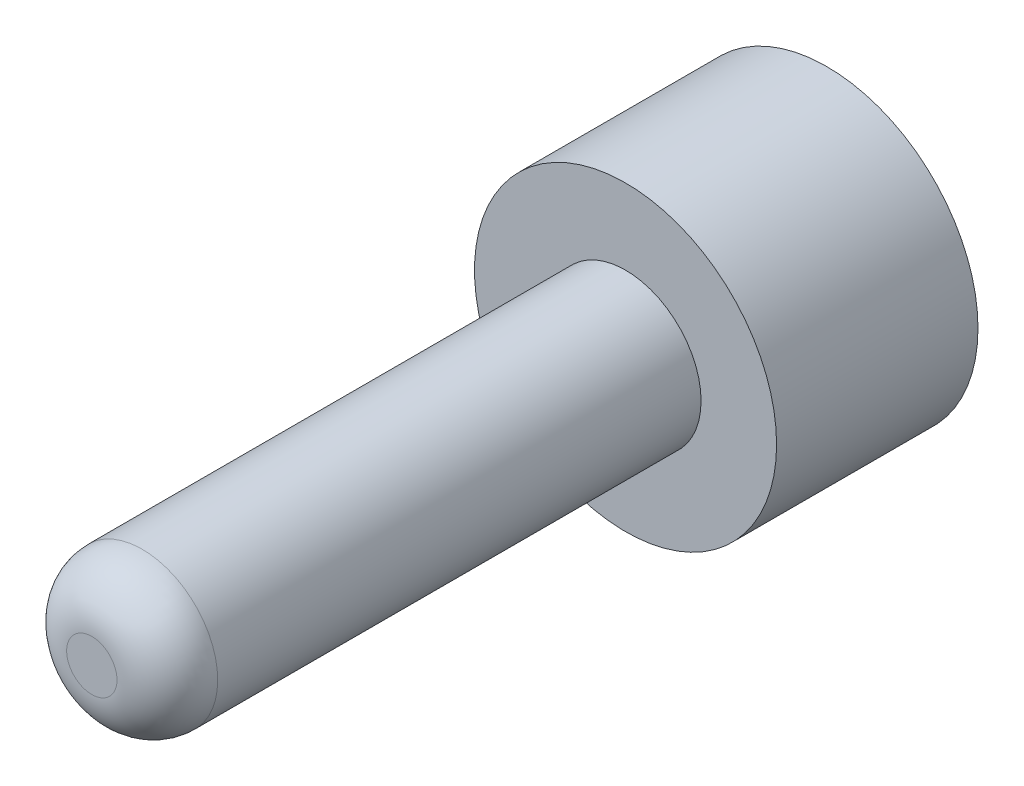
ISO-10303-21;
HEADER;
FILE_DESCRIPTION(('STEP AP214'),'2;1');
FILE_NAME('part.step','',(''),(''),'','','');
FILE_SCHEMA(('AUTOMOTIVE_DESIGN { 1 0 10303 214 1 1 1 1 }'));
ENDSEC;
DATA;
#1=APPLICATION_CONTEXT('core data for automotive mechanical design processes');
#2=APPLICATION_PROTOCOL_DEFINITION('international standard','automotive_design',2000,#1);
#3=PRODUCT_CONTEXT('',#1,'mechanical');
#4=PRODUCT('Part','Part','',(#3));
#5=PRODUCT_RELATED_PRODUCT_CATEGORY('part','',(#4));
#6=PRODUCT_DEFINITION_FORMATION('','',#4);
#7=PRODUCT_DEFINITION_CONTEXT('part definition',#1,'design');
#8=PRODUCT_DEFINITION('design','',#6,#7);
#9=PRODUCT_DEFINITION_SHAPE('','',#8);
#10=(LENGTH_UNIT() NAMED_UNIT(*) SI_UNIT(.MILLI.,.METRE.));
#11=(NAMED_UNIT(*) PLANE_ANGLE_UNIT() SI_UNIT($,.RADIAN.));
#12=(NAMED_UNIT(*) SI_UNIT($,.STERADIAN.) SOLID_ANGLE_UNIT());
#13=UNCERTAINTY_MEASURE_WITH_UNIT(LENGTH_MEASURE(1.E-05),#10,'distance_accuracy_value','');
#14=(GEOMETRIC_REPRESENTATION_CONTEXT(3) GLOBAL_UNCERTAINTY_ASSIGNED_CONTEXT((#13)) GLOBAL_UNIT_ASSIGNED_CONTEXT((#10,
#11,#12)) REPRESENTATION_CONTEXT('',''));
#15=CARTESIAN_POINT('',(0.,0.,0.));
#16=DIRECTION('',(0.,0.,1.));
#17=DIRECTION('',(1.,0.,0.));
#18=AXIS2_PLACEMENT_3D('',#15,#16,#17);
#19=CARTESIAN_POINT('',(0.,0.,2.));
#20=DIRECTION('',(0.,0.,1.));
#21=DIRECTION('',(1.,0.,0.));
#22=AXIS2_PLACEMENT_3D('',#19,#20,#21);
#23=PLANE('',#22);
#24=CARTESIAN_POINT('',(0.,0.,2.));
#25=DIRECTION('',(0.,0.,1.));
#26=DIRECTION('',(1.,0.,0.));
#27=AXIS2_PLACEMENT_3D('',#24,#25,#26);
#28=CIRCLE('',#27,1.5);
#29=CARTESIAN_POINT('',(1.5,0.,2.));
#30=VERTEX_POINT('',#29);
#31=EDGE_CURVE('E44',#30,#30,#28,.T.);
#32=ORIENTED_EDGE('',*,*,#31,.T.);
#33=EDGE_LOOP('',(#32));
#34=FACE_BOUND('',#33,.T.);
#35=CARTESIAN_POINT('',(0.,0.,2.));
#36=DIRECTION('',(0.,0.,1.));
#37=DIRECTION('',(1.,0.,0.));
#38=AXIS2_PLACEMENT_3D('',#35,#36,#37);
#39=CIRCLE('',#38,0.75);
#40=CARTESIAN_POINT('',(0.75,0.,2.));
#41=VERTEX_POINT('',#40);
#42=EDGE_CURVE('E52',#41,#41,#39,.T.);
#43=ORIENTED_EDGE('',*,*,#42,.F.);
#44=EDGE_LOOP('',(#43));
#45=FACE_BOUND('',#44,.T.);
#46=ADVANCED_FACE('F33',(#34,#45),#23,.T.);
#47=CARTESIAN_POINT('',(0.,0.,2.));
#48=DIRECTION('',(0.,0.,-1.));
#49=DIRECTION('',(-1.,0.,0.));
#50=AXIS2_PLACEMENT_3D('',#47,#48,#49);
#51=CYLINDRICAL_SURFACE('',#50,1.5);
#52=ORIENTED_EDGE('',*,*,#31,.F.);
#53=EDGE_LOOP('',(#52));
#54=FACE_BOUND('',#53,.T.);
#55=CARTESIAN_POINT('',(0.,0.,0.));
#56=DIRECTION('',(0.,0.,1.));
#57=DIRECTION('',(1.,0.,0.));
#58=AXIS2_PLACEMENT_3D('',#55,#56,#57);
#59=CIRCLE('',#58,1.5);
#60=CARTESIAN_POINT('',(1.5,0.,0.));
#61=VERTEX_POINT('',#60);
#62=EDGE_CURVE('E48',#61,#61,#59,.T.);
#63=ORIENTED_EDGE('',*,*,#62,.T.);
#64=EDGE_LOOP('',(#63));
#65=FACE_BOUND('',#64,.T.);
#66=ADVANCED_FACE('F60',(#54,#65),#51,.T.);
#67=CARTESIAN_POINT('',(0.,0.,0.));
#68=DIRECTION('',(0.,0.,1.));
#69=DIRECTION('',(1.,0.,0.));
#70=AXIS2_PLACEMENT_3D('',#67,#68,#69);
#71=PLANE('',#70);
#72=ORIENTED_EDGE('',*,*,#62,.F.);
#73=EDGE_LOOP('',(#72));
#74=FACE_BOUND('',#73,.T.);
#75=ADVANCED_FACE('F66',(#74),#71,.F.);
#76=CARTESIAN_POINT('',(0.,0.,7.3));
#77=DIRECTION('',(0.,0.,-1.));
#78=DIRECTION('',(-1.,0.,0.));
#79=AXIS2_PLACEMENT_3D('',#76,#77,#78);
#80=CYLINDRICAL_SURFACE('',#79,0.75);
#81=CARTESIAN_POINT('',(0.,0.,6.8));
#82=DIRECTION('',(0.,0.,1.));
#83=DIRECTION('',(1.,0.,0.));
#84=AXIS2_PLACEMENT_3D('',#81,#82,#83);
#85=CIRCLE('',#84,0.75);
#86=CARTESIAN_POINT('',(0.75,0.,6.8));
#87=VERTEX_POINT('',#86);
#88=EDGE_CURVE('E10',#87,#87,#85,.F.);
#89=ORIENTED_EDGE('',*,*,#88,.T.);
#90=EDGE_LOOP('',(#89));
#91=FACE_BOUND('',#90,.T.);
#92=ORIENTED_EDGE('',*,*,#42,.T.);
#93=EDGE_LOOP('',(#92));
#94=FACE_BOUND('',#93,.T.);
#95=ADVANCED_FACE('F57',(#91,#94),#80,.T.);
#96=CARTESIAN_POINT('',(0.,0.,7.3));
#97=DIRECTION('',(0.,0.,1.));
#98=DIRECTION('',(1.,0.,0.));
#99=AXIS2_PLACEMENT_3D('',#96,#97,#98);
#100=PLANE('',#99);
#101=CARTESIAN_POINT('',(0.,0.,7.3));
#102=DIRECTION('',(0.,0.,1.));
#103=DIRECTION('',(1.,0.,0.));
#104=AXIS2_PLACEMENT_3D('',#101,#102,#103);
#105=CIRCLE('',#104,0.25);
#106=CARTESIAN_POINT('',(0.25,0.,7.3));
#107=VERTEX_POINT('',#106);
#108=EDGE_CURVE('E40',#107,#107,#105,.T.);
#109=ORIENTED_EDGE('',*,*,#108,.T.);
#110=EDGE_LOOP('',(#109));
#111=FACE_BOUND('',#110,.T.);
#112=ADVANCED_FACE('F76',(#111),#100,.T.);
#113=CARTESIAN_POINT('',(0.,0.,6.8));
#114=DIRECTION('',(0.,0.,1.));
#115=DIRECTION('',(1.,0.,0.));
#116=AXIS2_PLACEMENT_3D('',#113,#114,#115);
#117=DEGENERATE_TOROIDAL_SURFACE('',#116,0.25,0.5,.T.);
#118=ORIENTED_EDGE('',*,*,#88,.F.);
#119=EDGE_LOOP('',(#118));
#120=FACE_BOUND('',#119,.T.);
#121=ORIENTED_EDGE('',*,*,#108,.F.);
#122=EDGE_LOOP('',(#121));
#123=FACE_BOUND('',#122,.T.);
#124=ADVANCED_FACE('F35',(#120,#123),#117,.T.);
#125=CLOSED_SHELL('',(#46,#66,#75,#95,#112,#124));
#126=MANIFOLD_SOLID_BREP('B2',#125);
#127=ADVANCED_BREP_SHAPE_REPRESENTATION('',(#18,#126),#14);
#128=SHAPE_DEFINITION_REPRESENTATION(#9,#127);
ENDSEC;
END-ISO-10303-21;
